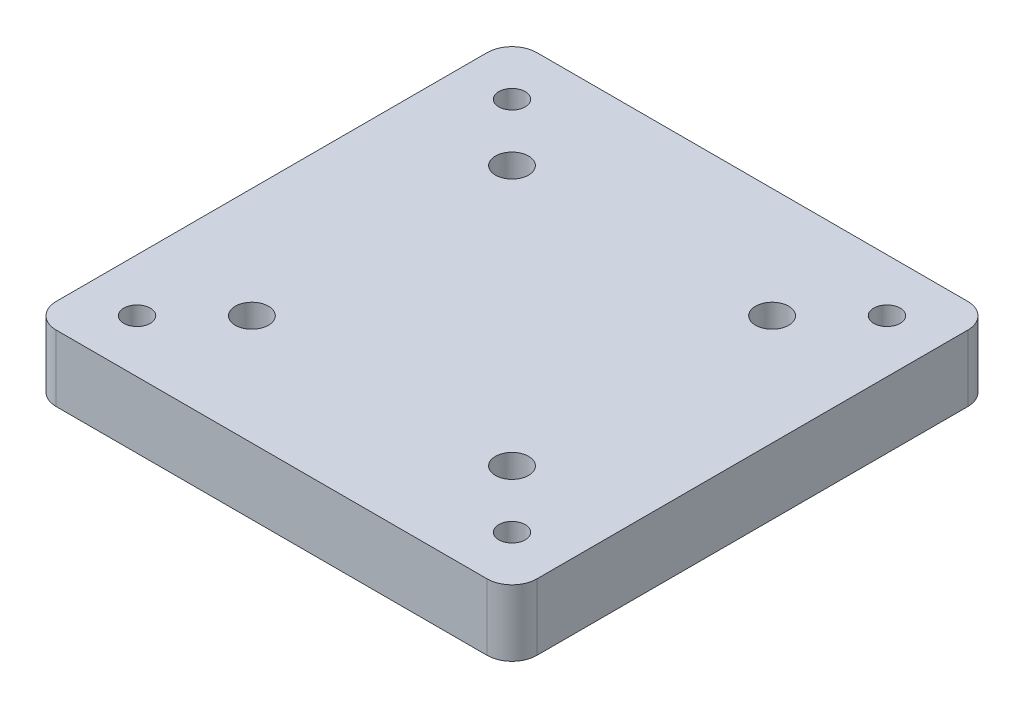
ISO-10303-21;
HEADER;
FILE_DESCRIPTION(('STEP AP214'),'2;1');
FILE_NAME('part.step','',(''),(''),'','','');
FILE_SCHEMA(('AUTOMOTIVE_DESIGN { 1 0 10303 214 1 1 1 1 }'));
ENDSEC;
DATA;
#1=APPLICATION_CONTEXT('core data for automotive mechanical design processes');
#2=APPLICATION_PROTOCOL_DEFINITION('international standard','automotive_design',2000,#1);
#3=PRODUCT_CONTEXT('',#1,'mechanical');
#4=PRODUCT('Part','Part','',(#3));
#5=PRODUCT_RELATED_PRODUCT_CATEGORY('part','',(#4));
#6=PRODUCT_DEFINITION_FORMATION('','',#4);
#7=PRODUCT_DEFINITION_CONTEXT('part definition',#1,'design');
#8=PRODUCT_DEFINITION('design','',#6,#7);
#9=PRODUCT_DEFINITION_SHAPE('','',#8);
#10=(LENGTH_UNIT() NAMED_UNIT(*) SI_UNIT(.MILLI.,.METRE.));
#11=(NAMED_UNIT(*) PLANE_ANGLE_UNIT() SI_UNIT($,.RADIAN.));
#12=(NAMED_UNIT(*) SI_UNIT($,.STERADIAN.) SOLID_ANGLE_UNIT());
#13=UNCERTAINTY_MEASURE_WITH_UNIT(LENGTH_MEASURE(1.E-05),#10,'distance_accuracy_value','');
#14=(GEOMETRIC_REPRESENTATION_CONTEXT(3) GLOBAL_UNCERTAINTY_ASSIGNED_CONTEXT((#13)) GLOBAL_UNIT_ASSIGNED_CONTEXT((#10,
#11,#12)) REPRESENTATION_CONTEXT('',''));
#15=CARTESIAN_POINT('',(0.,0.,0.));
#16=DIRECTION('',(0.,0.,1.));
#17=DIRECTION('',(1.,0.,0.));
#18=AXIS2_PLACEMENT_3D('',#15,#16,#17);
#19=CARTESIAN_POINT('',(-76.3410285265342,8.,55.2618637242953));
#20=DIRECTION('',(0.,-1.,0.));
#21=DIRECTION('',(0.,0.,-1.));
#22=AXIS2_PLACEMENT_3D('',#19,#20,#21);
#23=CYLINDRICAL_SURFACE('',#22,3.);
#24=CARTESIAN_POINT('',(-76.3410285265342,0.,55.2618637242953));
#25=DIRECTION('',(0.,1.,0.));
#26=DIRECTION('',(0.,0.,1.));
#27=AXIS2_PLACEMENT_3D('',#24,#25,#26);
#28=CIRCLE('',#27,3.);
#29=CARTESIAN_POINT('',(-76.3410285265341,0.,58.2618637242953));
#30=VERTEX_POINT('',#29);
#31=CARTESIAN_POINT('',(-79.3410285265342,0.,55.2618637242953));
#32=VERTEX_POINT('',#31);
#33=EDGE_CURVE('E202',#30,#32,#28,.F.);
#34=ORIENTED_EDGE('',*,*,#33,.F.);
#35=DIRECTION('',(0.,-1.,0.));
#36=VECTOR('',#35,1.);
#37=CARTESIAN_POINT('',(-76.3410285265341,8.,58.2618637242953));
#38=LINE('',#37,#36);
#39=CARTESIAN_POINT('',(-76.3410285265341,8.,58.2618637242953));
#40=VERTEX_POINT('',#39);
#41=EDGE_CURVE('E12',#40,#30,#38,.T.);
#42=ORIENTED_EDGE('',*,*,#41,.F.);
#43=CARTESIAN_POINT('',(-76.3410285265342,8.,55.2618637242953));
#44=DIRECTION('',(0.,1.,0.));
#45=DIRECTION('',(0.,0.,1.));
#46=AXIS2_PLACEMENT_3D('',#43,#44,#45);
#47=CIRCLE('',#46,3.);
#48=CARTESIAN_POINT('',(-79.3410285265342,8.,55.2618637242953));
#49=VERTEX_POINT('',#48);
#50=EDGE_CURVE('E246',#40,#49,#47,.F.);
#51=ORIENTED_EDGE('',*,*,#50,.T.);
#52=DIRECTION('',(0.,-1.,0.));
#53=VECTOR('',#52,1.);
#54=CARTESIAN_POINT('',(-79.3410285265342,8.,55.2618637242953));
#55=LINE('',#54,#53);
#56=EDGE_CURVE('E85',#49,#32,#55,.T.);
#57=ORIENTED_EDGE('',*,*,#56,.T.);
#58=EDGE_LOOP('',(#34,#42,#51,#57));
#59=FACE_BOUND('',#58,.T.);
#60=ADVANCED_FACE('F68',(#59),#23,.T.);
#61=CARTESIAN_POINT('',(0.,8.,58.2618637242953));
#62=DIRECTION('',(0.,0.,-1.));
#63=DIRECTION('',(-1.,0.,0.));
#64=AXIS2_PLACEMENT_3D('',#61,#62,#63);
#65=PLANE('',#64);
#66=DIRECTION('',(1.,0.,0.));
#67=VECTOR('',#66,1.);
#68=CARTESIAN_POINT('',(0.,0.,58.2618637242953));
#69=LINE('',#68,#67);
#70=CARTESIAN_POINT('',(-24.3410285265342,0.,58.2618637242953));
#71=VERTEX_POINT('',#70);
#72=EDGE_CURVE('E205',#30,#71,#69,.T.);
#73=ORIENTED_EDGE('',*,*,#72,.T.);
#74=DIRECTION('',(0.,-1.,0.));
#75=VECTOR('',#74,1.);
#76=CARTESIAN_POINT('',(-24.3410285265342,8.,58.2618637242953));
#77=LINE('',#76,#75);
#78=CARTESIAN_POINT('',(-24.3410285265342,8.,58.2618637242953));
#79=VERTEX_POINT('',#78);
#80=EDGE_CURVE('E77',#79,#71,#77,.T.);
#81=ORIENTED_EDGE('',*,*,#80,.F.);
#82=DIRECTION('',(1.,0.,0.));
#83=VECTOR('',#82,1.);
#84=CARTESIAN_POINT('',(0.,8.,58.2618637242953));
#85=LINE('',#84,#83);
#86=EDGE_CURVE('E446',#40,#79,#85,.T.);
#87=ORIENTED_EDGE('',*,*,#86,.F.);
#88=ORIENTED_EDGE('',*,*,#41,.T.);
#89=EDGE_LOOP('',(#73,#81,#87,#88));
#90=FACE_BOUND('',#89,.T.);
#91=ADVANCED_FACE('F269',(#90),#65,.F.);
#92=CARTESIAN_POINT('',(-24.3410285265342,8.,55.2618637242953));
#93=DIRECTION('',(0.,-1.,0.));
#94=DIRECTION('',(0.,0.,-1.));
#95=AXIS2_PLACEMENT_3D('',#92,#93,#94);
#96=CYLINDRICAL_SURFACE('',#95,3.);
#97=CARTESIAN_POINT('',(-24.3410285265342,0.,55.2618637242953));
#98=DIRECTION('',(0.,1.,0.));
#99=DIRECTION('',(0.,0.,1.));
#100=AXIS2_PLACEMENT_3D('',#97,#98,#99);
#101=CIRCLE('',#100,3.);
#102=CARTESIAN_POINT('',(-21.3410285265342,0.,55.2618637242953));
#103=VERTEX_POINT('',#102);
#104=EDGE_CURVE('E210',#103,#71,#101,.F.);
#105=ORIENTED_EDGE('',*,*,#104,.F.);
#106=DIRECTION('',(0.,-1.,0.));
#107=VECTOR('',#106,1.);
#108=CARTESIAN_POINT('',(-21.3410285265342,8.,55.2618637242953));
#109=LINE('',#108,#107);
#110=CARTESIAN_POINT('',(-21.3410285265342,8.,55.2618637242953));
#111=VERTEX_POINT('',#110);
#112=EDGE_CURVE('E257',#111,#103,#109,.T.);
#113=ORIENTED_EDGE('',*,*,#112,.F.);
#114=CARTESIAN_POINT('',(-24.3410285265342,8.,55.2618637242953));
#115=DIRECTION('',(0.,1.,0.));
#116=DIRECTION('',(0.,0.,1.));
#117=AXIS2_PLACEMENT_3D('',#114,#115,#116);
#118=CIRCLE('',#117,3.);
#119=EDGE_CURVE('E266',#111,#79,#118,.F.);
#120=ORIENTED_EDGE('',*,*,#119,.T.);
#121=ORIENTED_EDGE('',*,*,#80,.T.);
#122=EDGE_LOOP('',(#105,#113,#120,#121));
#123=FACE_BOUND('',#122,.T.);
#124=ADVANCED_FACE('F264',(#123),#96,.T.);
#125=CARTESIAN_POINT('',(-21.3410285265342,8.,0.));
#126=DIRECTION('',(-1.,0.,0.));
#127=DIRECTION('',(0.,0.,1.));
#128=AXIS2_PLACEMENT_3D('',#125,#126,#127);
#129=PLANE('',#128);
#130=DIRECTION('',(0.,0.,-1.));
#131=VECTOR('',#130,1.);
#132=CARTESIAN_POINT('',(-21.3410285265342,0.,0.));
#133=LINE('',#132,#131);
#134=CARTESIAN_POINT('',(-21.3410285265342,0.,3.26186372429536));
#135=VERTEX_POINT('',#134);
#136=EDGE_CURVE('E214',#103,#135,#133,.T.);
#137=ORIENTED_EDGE('',*,*,#136,.T.);
#138=DIRECTION('',(0.,-1.,0.));
#139=VECTOR('',#138,1.);
#140=CARTESIAN_POINT('',(-21.3410285265342,8.,3.26186372429536));
#141=LINE('',#140,#139);
#142=CARTESIAN_POINT('',(-21.3410285265342,8.,3.26186372429536));
#143=VERTEX_POINT('',#142);
#144=EDGE_CURVE('E253',#143,#135,#141,.T.);
#145=ORIENTED_EDGE('',*,*,#144,.F.);
#146=DIRECTION('',(0.,0.,-1.));
#147=VECTOR('',#146,1.);
#148=CARTESIAN_POINT('',(-21.3410285265342,8.,0.));
#149=LINE('',#148,#147);
#150=EDGE_CURVE('E164',#111,#143,#149,.T.);
#151=ORIENTED_EDGE('',*,*,#150,.F.);
#152=ORIENTED_EDGE('',*,*,#112,.T.);
#153=EDGE_LOOP('',(#137,#145,#151,#152));
#154=FACE_BOUND('',#153,.T.);
#155=ADVANCED_FACE('F277',(#154),#129,.F.);
#156=CARTESIAN_POINT('',(-24.3410285265342,8.,3.26186372429534));
#157=DIRECTION('',(0.,-1.,0.));
#158=DIRECTION('',(0.,0.,-1.));
#159=AXIS2_PLACEMENT_3D('',#156,#157,#158);
#160=CYLINDRICAL_SURFACE('',#159,3.);
#161=CARTESIAN_POINT('',(-24.3410285265342,0.,3.26186372429534));
#162=DIRECTION('',(0.,1.,0.));
#163=DIRECTION('',(0.,0.,1.));
#164=AXIS2_PLACEMENT_3D('',#161,#162,#163);
#165=CIRCLE('',#164,3.);
#166=CARTESIAN_POINT('',(-24.3410285265342,0.,0.26186372429534));
#167=VERTEX_POINT('',#166);
#168=EDGE_CURVE('E217',#135,#167,#165,.T.);
#169=ORIENTED_EDGE('',*,*,#168,.T.);
#170=DIRECTION('',(0.,-1.,0.));
#171=VECTOR('',#170,1.);
#172=CARTESIAN_POINT('',(-24.3410285265342,8.,0.26186372429534));
#173=LINE('',#172,#171);
#174=CARTESIAN_POINT('',(-24.3410285265342,8.,0.26186372429534));
#175=VERTEX_POINT('',#174);
#176=EDGE_CURVE('E146',#175,#167,#173,.T.);
#177=ORIENTED_EDGE('',*,*,#176,.F.);
#178=CARTESIAN_POINT('',(-24.3410285265342,8.,3.26186372429534));
#179=DIRECTION('',(0.,1.,0.));
#180=DIRECTION('',(0.,0.,1.));
#181=AXIS2_PLACEMENT_3D('',#178,#179,#180);
#182=CIRCLE('',#181,3.);
#183=EDGE_CURVE('E159',#143,#175,#182,.T.);
#184=ORIENTED_EDGE('',*,*,#183,.F.);
#185=ORIENTED_EDGE('',*,*,#144,.T.);
#186=EDGE_LOOP('',(#169,#177,#184,#185));
#187=FACE_BOUND('',#186,.T.);
#188=ADVANCED_FACE('F280',(#187),#160,.T.);
#189=CARTESIAN_POINT('',(0.,8.,0.26186372429534));
#190=DIRECTION('',(0.,0.,-1.));
#191=DIRECTION('',(-1.,0.,0.));
#192=AXIS2_PLACEMENT_3D('',#189,#190,#191);
#193=PLANE('',#192);
#194=DIRECTION('',(1.,0.,0.));
#195=VECTOR('',#194,1.);
#196=CARTESIAN_POINT('',(0.,0.,0.26186372429534));
#197=LINE('',#196,#195);
#198=CARTESIAN_POINT('',(-76.3410285265341,0.,0.26186372429534));
#199=VERTEX_POINT('',#198);
#200=EDGE_CURVE('E142',#199,#167,#197,.T.);
#201=ORIENTED_EDGE('',*,*,#200,.F.);
#202=DIRECTION('',(0.,-1.,0.));
#203=VECTOR('',#202,1.);
#204=CARTESIAN_POINT('',(-76.3410285265341,8.,0.26186372429534));
#205=LINE('',#204,#203);
#206=CARTESIAN_POINT('',(-76.3410285265341,8.,0.26186372429534));
#207=VERTEX_POINT('',#206);
#208=EDGE_CURVE('E136',#207,#199,#205,.T.);
#209=ORIENTED_EDGE('',*,*,#208,.F.);
#210=DIRECTION('',(1.,0.,0.));
#211=VECTOR('',#210,1.);
#212=CARTESIAN_POINT('',(0.,8.,0.26186372429534));
#213=LINE('',#212,#211);
#214=EDGE_CURVE('E140',#207,#175,#213,.T.);
#215=ORIENTED_EDGE('',*,*,#214,.T.);
#216=ORIENTED_EDGE('',*,*,#176,.T.);
#217=EDGE_LOOP('',(#201,#209,#215,#216));
#218=FACE_BOUND('',#217,.T.);
#219=ADVANCED_FACE('F138',(#218),#193,.T.);
#220=CARTESIAN_POINT('',(-76.3410285265342,8.,3.26186372429534));
#221=DIRECTION('',(0.,-1.,0.));
#222=DIRECTION('',(0.,0.,-1.));
#223=AXIS2_PLACEMENT_3D('',#220,#221,#222);
#224=CYLINDRICAL_SURFACE('',#223,3.);
#225=CARTESIAN_POINT('',(-76.3410285265342,0.,3.26186372429534));
#226=DIRECTION('',(0.,1.,0.));
#227=DIRECTION('',(0.,0.,1.));
#228=AXIS2_PLACEMENT_3D('',#225,#226,#227);
#229=CIRCLE('',#228,3.);
#230=CARTESIAN_POINT('',(-79.3410285265342,0.,3.26186372429536));
#231=VERTEX_POINT('',#230);
#232=EDGE_CURVE('E223',#199,#231,#229,.T.);
#233=ORIENTED_EDGE('',*,*,#232,.T.);
#234=DIRECTION('',(0.,-1.,0.));
#235=VECTOR('',#234,1.);
#236=CARTESIAN_POINT('',(-79.3410285265342,8.,3.26186372429536));
#237=LINE('',#236,#235);
#238=CARTESIAN_POINT('',(-79.3410285265342,8.,3.26186372429536));
#239=VERTEX_POINT('',#238);
#240=EDGE_CURVE('E111',#239,#231,#237,.T.);
#241=ORIENTED_EDGE('',*,*,#240,.F.);
#242=CARTESIAN_POINT('',(-76.3410285265342,8.,3.26186372429534));
#243=DIRECTION('',(0.,1.,0.));
#244=DIRECTION('',(0.,0.,1.));
#245=AXIS2_PLACEMENT_3D('',#242,#243,#244);
#246=CIRCLE('',#245,3.);
#247=EDGE_CURVE('E148',#207,#239,#246,.T.);
#248=ORIENTED_EDGE('',*,*,#247,.F.);
#249=ORIENTED_EDGE('',*,*,#208,.T.);
#250=EDGE_LOOP('',(#233,#241,#248,#249));
#251=FACE_BOUND('',#250,.T.);
#252=ADVANCED_FACE('F149',(#251),#224,.T.);
#253=CARTESIAN_POINT('',(-66.0360285265342,8.,44.9568637242954));
#254=DIRECTION('',(0.,-1.,0.));
#255=DIRECTION('',(0.,0.,-1.));
#256=AXIS2_PLACEMENT_3D('',#253,#254,#255);
#257=CYLINDRICAL_SURFACE('',#256,2.);
#258=CARTESIAN_POINT('',(-66.0360285265342,8.,44.9568637242954));
#259=DIRECTION('',(0.,1.,0.));
#260=DIRECTION('',(0.,0.,1.));
#261=AXIS2_PLACEMENT_3D('',#258,#259,#260);
#262=CIRCLE('',#261,2.);
#263=CARTESIAN_POINT('',(-66.0360285265342,8.,46.9568637242953));
#264=VERTEX_POINT('',#263);
#265=EDGE_CURVE('E194',#264,#264,#262,.T.);
#266=ORIENTED_EDGE('',*,*,#265,.T.);
#267=EDGE_LOOP('',(#266));
#268=FACE_BOUND('',#267,.T.);
#269=CARTESIAN_POINT('',(-66.0360285265342,-2.,44.9568637242954));
#270=DIRECTION('',(0.,1.,0.));
#271=DIRECTION('',(0.,0.,1.));
#272=AXIS2_PLACEMENT_3D('',#269,#270,#271);
#273=CIRCLE('',#272,2.);
#274=CARTESIAN_POINT('',(-66.0360285265342,-2.,46.9568637242953));
#275=VERTEX_POINT('',#274);
#276=EDGE_CURVE('E426',#275,#275,#273,.T.);
#277=ORIENTED_EDGE('',*,*,#276,.F.);
#278=EDGE_LOOP('',(#277));
#279=FACE_BOUND('',#278,.T.);
#280=ADVANCED_FACE('F311',(#268,#279),#257,.F.);
#281=CARTESIAN_POINT('',(-34.6460285265341,8.,13.5668637242953));
#282=DIRECTION('',(0.,-1.,0.));
#283=DIRECTION('',(0.,0.,-1.));
#284=AXIS2_PLACEMENT_3D('',#281,#282,#283);
#285=CYLINDRICAL_SURFACE('',#284,2.);
#286=CARTESIAN_POINT('',(-34.6460285265341,8.,13.5668637242953));
#287=DIRECTION('',(0.,1.,0.));
#288=DIRECTION('',(0.,0.,1.));
#289=AXIS2_PLACEMENT_3D('',#286,#287,#288);
#290=CIRCLE('',#289,2.);
#291=CARTESIAN_POINT('',(-34.6460285265341,8.,15.5668637242953));
#292=VERTEX_POINT('',#291);
#293=EDGE_CURVE('E190',#292,#292,#290,.T.);
#294=ORIENTED_EDGE('',*,*,#293,.T.);
#295=EDGE_LOOP('',(#294));
#296=FACE_BOUND('',#295,.T.);
#297=CARTESIAN_POINT('',(-34.6460285265341,-2.,13.5668637242953));
#298=DIRECTION('',(0.,1.,0.));
#299=DIRECTION('',(0.,0.,1.));
#300=AXIS2_PLACEMENT_3D('',#297,#298,#299);
#301=CIRCLE('',#300,2.);
#302=CARTESIAN_POINT('',(-34.6460285265341,-2.,15.5668637242953));
#303=VERTEX_POINT('',#302);
#304=EDGE_CURVE('E401',#303,#303,#301,.T.);
#305=ORIENTED_EDGE('',*,*,#304,.F.);
#306=EDGE_LOOP('',(#305));
#307=FACE_BOUND('',#306,.T.);
#308=ADVANCED_FACE('F315',(#296,#307),#285,.F.);
#309=CARTESIAN_POINT('',(-66.0360285265342,8.,13.5668637242953));
#310=DIRECTION('',(0.,-1.,0.));
#311=DIRECTION('',(0.,0.,-1.));
#312=AXIS2_PLACEMENT_3D('',#309,#310,#311);
#313=CYLINDRICAL_SURFACE('',#312,2.);
#314=CARTESIAN_POINT('',(-66.0360285265342,8.,13.5668637242953));
#315=DIRECTION('',(0.,1.,0.));
#316=DIRECTION('',(0.,0.,1.));
#317=AXIS2_PLACEMENT_3D('',#314,#315,#316);
#318=CIRCLE('',#317,2.);
#319=CARTESIAN_POINT('',(-66.0360285265342,8.,15.5668637242953));
#320=VERTEX_POINT('',#319);
#321=EDGE_CURVE('E186',#320,#320,#318,.T.);
#322=ORIENTED_EDGE('',*,*,#321,.T.);
#323=EDGE_LOOP('',(#322));
#324=FACE_BOUND('',#323,.T.);
#325=CARTESIAN_POINT('',(-66.0360285265342,-2.,13.5668637242953));
#326=DIRECTION('',(0.,1.,0.));
#327=DIRECTION('',(0.,0.,1.));
#328=AXIS2_PLACEMENT_3D('',#325,#326,#327);
#329=CIRCLE('',#328,2.);
#330=CARTESIAN_POINT('',(-66.0360285265342,-2.,15.5668637242953));
#331=VERTEX_POINT('',#330);
#332=EDGE_CURVE('E414',#331,#331,#329,.T.);
#333=ORIENTED_EDGE('',*,*,#332,.F.);
#334=EDGE_LOOP('',(#333));
#335=FACE_BOUND('',#334,.T.);
#336=ADVANCED_FACE('F321',(#324,#335),#313,.F.);
#337=CARTESIAN_POINT('',(-72.9660285265341,8.,6.63686372429535));
#338=DIRECTION('',(0.,-1.,0.));
#339=DIRECTION('',(0.,0.,-1.));
#340=AXIS2_PLACEMENT_3D('',#337,#338,#339);
#341=CYLINDRICAL_SURFACE('',#340,1.59867119920185);
#342=CARTESIAN_POINT('',(-72.9660285265341,8.,6.63686372429535));
#343=DIRECTION('',(0.,1.,0.));
#344=DIRECTION('',(0.,0.,1.));
#345=AXIS2_PLACEMENT_3D('',#342,#343,#344);
#346=CIRCLE('',#345,1.59867119920185);
#347=CARTESIAN_POINT('',(-72.9660285265341,8.,8.2355349234972));
#348=VERTEX_POINT('',#347);
#349=EDGE_CURVE('E182',#348,#348,#346,.T.);
#350=ORIENTED_EDGE('',*,*,#349,.T.);
#351=EDGE_LOOP('',(#350));
#352=FACE_BOUND('',#351,.T.);
#353=CARTESIAN_POINT('',(-72.9660285265341,0.,6.63686372429535));
#354=DIRECTION('',(0.,1.,0.));
#355=DIRECTION('',(0.,0.,1.));
#356=AXIS2_PLACEMENT_3D('',#353,#354,#355);
#357=CIRCLE('',#356,1.59867119920185);
#358=CARTESIAN_POINT('',(-72.9660285265341,0.,8.2355349234972));
#359=VERTEX_POINT('',#358);
#360=EDGE_CURVE('E242',#359,#359,#357,.T.);
#361=ORIENTED_EDGE('',*,*,#360,.F.);
#362=EDGE_LOOP('',(#361));
#363=FACE_BOUND('',#362,.T.);
#364=ADVANCED_FACE('F329',(#352,#363),#341,.F.);
#365=CARTESIAN_POINT('',(-27.7160285265342,8.,6.63686372429535));
#366=DIRECTION('',(0.,-1.,0.));
#367=DIRECTION('',(0.,0.,-1.));
#368=AXIS2_PLACEMENT_3D('',#365,#366,#367);
#369=CYLINDRICAL_SURFACE('',#368,1.6);
#370=CARTESIAN_POINT('',(-27.7160285265342,8.,6.63686372429535));
#371=DIRECTION('',(0.,1.,0.));
#372=DIRECTION('',(0.,0.,1.));
#373=AXIS2_PLACEMENT_3D('',#370,#371,#372);
#374=CIRCLE('',#373,1.6);
#375=CARTESIAN_POINT('',(-27.7160285265342,8.,8.23686372429535));
#376=VERTEX_POINT('',#375);
#377=EDGE_CURVE('E178',#376,#376,#374,.T.);
#378=ORIENTED_EDGE('',*,*,#377,.T.);
#379=EDGE_LOOP('',(#378));
#380=FACE_BOUND('',#379,.T.);
#381=CARTESIAN_POINT('',(-27.7160285265342,0.,6.63686372429535));
#382=DIRECTION('',(0.,1.,0.));
#383=DIRECTION('',(0.,0.,1.));
#384=AXIS2_PLACEMENT_3D('',#381,#382,#383);
#385=CIRCLE('',#384,1.6);
#386=CARTESIAN_POINT('',(-27.7160285265342,0.,8.23686372429535));
#387=VERTEX_POINT('',#386);
#388=EDGE_CURVE('E238',#387,#387,#385,.T.);
#389=ORIENTED_EDGE('',*,*,#388,.F.);
#390=EDGE_LOOP('',(#389));
#391=FACE_BOUND('',#390,.T.);
#392=ADVANCED_FACE('F333',(#380,#391),#369,.F.);
#393=CARTESIAN_POINT('',(-27.7160285265342,8.,51.8868637242953));
#394=DIRECTION('',(0.,-1.,0.));
#395=DIRECTION('',(0.,0.,-1.));
#396=AXIS2_PLACEMENT_3D('',#393,#394,#395);
#397=CYLINDRICAL_SURFACE('',#396,1.59864976084246);
#398=CARTESIAN_POINT('',(-27.7160285265342,8.,51.8868637242953));
#399=DIRECTION('',(0.,1.,0.));
#400=DIRECTION('',(0.,0.,1.));
#401=AXIS2_PLACEMENT_3D('',#398,#399,#400);
#402=CIRCLE('',#401,1.59864976084246);
#403=CARTESIAN_POINT('',(-27.7160285265342,8.,53.4855134851378));
#404=VERTEX_POINT('',#403);
#405=EDGE_CURVE('E174',#404,#404,#402,.T.);
#406=ORIENTED_EDGE('',*,*,#405,.T.);
#407=EDGE_LOOP('',(#406));
#408=FACE_BOUND('',#407,.T.);
#409=CARTESIAN_POINT('',(-27.7160285265342,0.,51.8868637242953));
#410=DIRECTION('',(0.,1.,0.));
#411=DIRECTION('',(0.,0.,1.));
#412=AXIS2_PLACEMENT_3D('',#409,#410,#411);
#413=CIRCLE('',#412,1.59864976084246);
#414=CARTESIAN_POINT('',(-27.7160285265342,0.,53.4855134851378));
#415=VERTEX_POINT('',#414);
#416=EDGE_CURVE('E234',#415,#415,#413,.T.);
#417=ORIENTED_EDGE('',*,*,#416,.F.);
#418=EDGE_LOOP('',(#417));
#419=FACE_BOUND('',#418,.T.);
#420=ADVANCED_FACE('F292',(#408,#419),#397,.F.);
#421=CARTESIAN_POINT('',(-72.9660285265341,8.,51.8868637242953));
#422=DIRECTION('',(0.,-1.,0.));
#423=DIRECTION('',(0.,0.,-1.));
#424=AXIS2_PLACEMENT_3D('',#421,#422,#423);
#425=CYLINDRICAL_SURFACE('',#424,1.59999999999998);
#426=CARTESIAN_POINT('',(-72.9660285265341,8.,51.8868637242953));
#427=DIRECTION('',(0.,1.,0.));
#428=DIRECTION('',(0.,0.,1.));
#429=AXIS2_PLACEMENT_3D('',#426,#427,#428);
#430=CIRCLE('',#429,1.59999999999998);
#431=CARTESIAN_POINT('',(-72.9660285265341,8.,53.4868637242953));
#432=VERTEX_POINT('',#431);
#433=EDGE_CURVE('E170',#432,#432,#430,.T.);
#434=ORIENTED_EDGE('',*,*,#433,.T.);
#435=EDGE_LOOP('',(#434));
#436=FACE_BOUND('',#435,.T.);
#437=CARTESIAN_POINT('',(-72.9660285265341,0.,51.8868637242953));
#438=DIRECTION('',(0.,1.,0.));
#439=DIRECTION('',(0.,0.,1.));
#440=AXIS2_PLACEMENT_3D('',#437,#438,#439);
#441=CIRCLE('',#440,1.59999999999998);
#442=CARTESIAN_POINT('',(-72.9660285265341,0.,53.4868637242953));
#443=VERTEX_POINT('',#442);
#444=EDGE_CURVE('E230',#443,#443,#441,.T.);
#445=ORIENTED_EDGE('',*,*,#444,.F.);
#446=EDGE_LOOP('',(#445));
#447=FACE_BOUND('',#446,.T.);
#448=ADVANCED_FACE('F284',(#436,#447),#425,.F.);
#449=CARTESIAN_POINT('',(-79.3410285265342,8.,0.));
#450=DIRECTION('',(-1.,0.,0.));
#451=DIRECTION('',(0.,0.,1.));
#452=AXIS2_PLACEMENT_3D('',#449,#450,#451);
#453=PLANE('',#452);
#454=DIRECTION('',(0.,0.,-1.));
#455=VECTOR('',#454,1.);
#456=CARTESIAN_POINT('',(-79.3410285265342,0.,0.));
#457=LINE('',#456,#455);
#458=EDGE_CURVE('E226',#32,#231,#457,.T.);
#459=ORIENTED_EDGE('',*,*,#458,.F.);
#460=ORIENTED_EDGE('',*,*,#56,.F.);
#461=DIRECTION('',(0.,0.,-1.));
#462=VECTOR('',#461,1.);
#463=CARTESIAN_POINT('',(-79.3410285265342,8.,0.));
#464=LINE('',#463,#462);
#465=EDGE_CURVE('E153',#49,#239,#464,.T.);
#466=ORIENTED_EDGE('',*,*,#465,.T.);
#467=ORIENTED_EDGE('',*,*,#240,.T.);
#468=EDGE_LOOP('',(#459,#460,#466,#467));
#469=FACE_BOUND('',#468,.T.);
#470=ADVANCED_FACE('F281',(#469),#453,.T.);
#471=CARTESIAN_POINT('',(-34.6460285265341,8.,44.9568637242954));
#472=DIRECTION('',(0.,-1.,0.));
#473=DIRECTION('',(0.,0.,-1.));
#474=AXIS2_PLACEMENT_3D('',#471,#472,#473);
#475=CYLINDRICAL_SURFACE('',#474,2.);
#476=CARTESIAN_POINT('',(-34.6460285265341,8.,44.9568637242954));
#477=DIRECTION('',(0.,1.,0.));
#478=DIRECTION('',(0.,0.,1.));
#479=AXIS2_PLACEMENT_3D('',#476,#477,#478);
#480=CIRCLE('',#479,2.);
#481=CARTESIAN_POINT('',(-34.6460285265341,8.,46.9568637242954));
#482=VERTEX_POINT('',#481);
#483=EDGE_CURVE('E198',#482,#482,#480,.T.);
#484=ORIENTED_EDGE('',*,*,#483,.T.);
#485=EDGE_LOOP('',(#484));
#486=FACE_BOUND('',#485,.T.);
#487=CARTESIAN_POINT('',(-34.6460285265341,-2.,44.9568637242954));
#488=DIRECTION('',(0.,1.,0.));
#489=DIRECTION('',(0.,0.,1.));
#490=AXIS2_PLACEMENT_3D('',#487,#488,#489);
#491=CIRCLE('',#490,2.);
#492=CARTESIAN_POINT('',(-34.6460285265341,-2.,46.9568637242954));
#493=VERTEX_POINT('',#492);
#494=EDGE_CURVE('E433',#493,#493,#491,.T.);
#495=ORIENTED_EDGE('',*,*,#494,.F.);
#496=EDGE_LOOP('',(#495));
#497=FACE_BOUND('',#496,.T.);
#498=ADVANCED_FACE('F283',(#486,#497),#475,.F.);
#499=CARTESIAN_POINT('',(0.,8.,0.));
#500=DIRECTION('',(0.,1.,0.));
#501=DIRECTION('',(0.,0.,1.));
#502=AXIS2_PLACEMENT_3D('',#499,#500,#501);
#503=PLANE('',#502);
#504=ORIENTED_EDGE('',*,*,#50,.F.);
#505=ORIENTED_EDGE('',*,*,#86,.T.);
#506=ORIENTED_EDGE('',*,*,#119,.F.);
#507=ORIENTED_EDGE('',*,*,#150,.T.);
#508=ORIENTED_EDGE('',*,*,#183,.T.);
#509=ORIENTED_EDGE('',*,*,#214,.F.);
#510=ORIENTED_EDGE('',*,*,#247,.T.);
#511=ORIENTED_EDGE('',*,*,#465,.F.);
#512=EDGE_LOOP('',(#504,#505,#506,#507,#508,#509,#510,#511));
#513=FACE_BOUND('',#512,.T.);
#514=ORIENTED_EDGE('',*,*,#433,.F.);
#515=EDGE_LOOP('',(#514));
#516=FACE_BOUND('',#515,.T.);
#517=ORIENTED_EDGE('',*,*,#405,.F.);
#518=EDGE_LOOP('',(#517));
#519=FACE_BOUND('',#518,.T.);
#520=ORIENTED_EDGE('',*,*,#377,.F.);
#521=EDGE_LOOP('',(#520));
#522=FACE_BOUND('',#521,.T.);
#523=ORIENTED_EDGE('',*,*,#349,.F.);
#524=EDGE_LOOP('',(#523));
#525=FACE_BOUND('',#524,.T.);
#526=ORIENTED_EDGE('',*,*,#321,.F.);
#527=EDGE_LOOP('',(#526));
#528=FACE_BOUND('',#527,.T.);
#529=ORIENTED_EDGE('',*,*,#293,.F.);
#530=EDGE_LOOP('',(#529));
#531=FACE_BOUND('',#530,.T.);
#532=ORIENTED_EDGE('',*,*,#265,.F.);
#533=EDGE_LOOP('',(#532));
#534=FACE_BOUND('',#533,.T.);
#535=ORIENTED_EDGE('',*,*,#483,.F.);
#536=EDGE_LOOP('',(#535));
#537=FACE_BOUND('',#536,.T.);
#538=ADVANCED_FACE('F156',(#513,#516,#519,#522,#525,#528,#531,#534,#537),#503,.T.);
#539=CARTESIAN_POINT('',(0.,0.,0.));
#540=DIRECTION('',(0.,1.,0.));
#541=DIRECTION('',(0.,0.,1.));
#542=AXIS2_PLACEMENT_3D('',#539,#540,#541);
#543=PLANE('',#542);
#544=CARTESIAN_POINT('',(-34.6460285265341,0.,13.5668637242953));
#545=DIRECTION('',(0.,1.,0.));
#546=DIRECTION('',(0.,0.,1.));
#547=AXIS2_PLACEMENT_3D('',#544,#545,#546);
#548=CIRCLE('',#547,6.);
#549=CARTESIAN_POINT('',(-34.6460285265341,0.,19.5668637242953));
#550=VERTEX_POINT('',#549);
#551=EDGE_CURVE('E399',#550,#550,#548,.T.);
#552=ORIENTED_EDGE('',*,*,#551,.T.);
#553=EDGE_LOOP('',(#552));
#554=FACE_BOUND('',#553,.T.);
#555=CARTESIAN_POINT('',(-66.0360285265342,0.,13.5668637242953));
#556=DIRECTION('',(0.,1.,0.));
#557=DIRECTION('',(0.,0.,1.));
#558=AXIS2_PLACEMENT_3D('',#555,#556,#557);
#559=CIRCLE('',#558,6.);
#560=CARTESIAN_POINT('',(-66.0360285265342,0.,19.5668637242953));
#561=VERTEX_POINT('',#560);
#562=EDGE_CURVE('E410',#561,#561,#559,.T.);
#563=ORIENTED_EDGE('',*,*,#562,.T.);
#564=EDGE_LOOP('',(#563));
#565=FACE_BOUND('',#564,.T.);
#566=CARTESIAN_POINT('',(-66.0360285265342,0.,44.9568637242954));
#567=DIRECTION('',(0.,1.,0.));
#568=DIRECTION('',(0.,0.,1.));
#569=AXIS2_PLACEMENT_3D('',#566,#567,#568);
#570=CIRCLE('',#569,6.);
#571=CARTESIAN_POINT('',(-66.0360285265342,0.,50.9568637242954));
#572=VERTEX_POINT('',#571);
#573=EDGE_CURVE('E422',#572,#572,#570,.T.);
#574=ORIENTED_EDGE('',*,*,#573,.T.);
#575=EDGE_LOOP('',(#574));
#576=FACE_BOUND('',#575,.T.);
#577=CARTESIAN_POINT('',(-34.6460285265341,0.,44.9568637242954));
#578=DIRECTION('',(0.,1.,0.));
#579=DIRECTION('',(0.,0.,1.));
#580=AXIS2_PLACEMENT_3D('',#577,#578,#579);
#581=CIRCLE('',#580,6.);
#582=CARTESIAN_POINT('',(-34.6460285265341,0.,50.9568637242954));
#583=VERTEX_POINT('',#582);
#584=EDGE_CURVE('E437',#583,#583,#581,.T.);
#585=ORIENTED_EDGE('',*,*,#584,.T.);
#586=EDGE_LOOP('',(#585));
#587=FACE_BOUND('',#586,.T.);
#588=ORIENTED_EDGE('',*,*,#33,.T.);
#589=ORIENTED_EDGE('',*,*,#458,.T.);
#590=ORIENTED_EDGE('',*,*,#232,.F.);
#591=ORIENTED_EDGE('',*,*,#200,.T.);
#592=ORIENTED_EDGE('',*,*,#168,.F.);
#593=ORIENTED_EDGE('',*,*,#136,.F.);
#594=ORIENTED_EDGE('',*,*,#104,.T.);
#595=ORIENTED_EDGE('',*,*,#72,.F.);
#596=EDGE_LOOP('',(#588,#589,#590,#591,#592,#593,#594,#595));
#597=FACE_BOUND('',#596,.T.);
#598=ORIENTED_EDGE('',*,*,#444,.T.);
#599=EDGE_LOOP('',(#598));
#600=FACE_BOUND('',#599,.T.);
#601=ORIENTED_EDGE('',*,*,#416,.T.);
#602=EDGE_LOOP('',(#601));
#603=FACE_BOUND('',#602,.T.);
#604=ORIENTED_EDGE('',*,*,#388,.T.);
#605=EDGE_LOOP('',(#604));
#606=FACE_BOUND('',#605,.T.);
#607=ORIENTED_EDGE('',*,*,#360,.T.);
#608=EDGE_LOOP('',(#607));
#609=FACE_BOUND('',#608,.T.);
#610=ADVANCED_FACE('F272',(#554,#565,#576,#587,#597,#600,#603,#606,#609),#543,.F.);
#611=CARTESIAN_POINT('',(-34.6460285265341,-2.,44.9568637242954));
#612=DIRECTION('',(0.,1.,0.));
#613=DIRECTION('',(0.,0.,1.));
#614=AXIS2_PLACEMENT_3D('',#611,#612,#613);
#615=CYLINDRICAL_SURFACE('',#614,6.);
#616=CARTESIAN_POINT('',(-34.6460285265341,-2.,44.9568637242954));
#617=DIRECTION('',(0.,1.,0.));
#618=DIRECTION('',(0.,0.,1.));
#619=AXIS2_PLACEMENT_3D('',#616,#617,#618);
#620=CIRCLE('',#619,6.);
#621=CARTESIAN_POINT('',(-34.6460285265341,-2.,50.9568637242954));
#622=VERTEX_POINT('',#621);
#623=EDGE_CURVE('E206',#622,#622,#620,.T.);
#624=ORIENTED_EDGE('',*,*,#623,.T.);
#625=EDGE_LOOP('',(#624));
#626=FACE_BOUND('',#625,.T.);
#627=ORIENTED_EDGE('',*,*,#584,.F.);
#628=EDGE_LOOP('',(#627));
#629=FACE_BOUND('',#628,.T.);
#630=ADVANCED_FACE('F348',(#626,#629),#615,.T.);
#631=CARTESIAN_POINT('',(-34.6460285265341,-2.,44.9568637242954));
#632=DIRECTION('',(0.,1.,0.));
#633=DIRECTION('',(0.,0.,1.));
#634=AXIS2_PLACEMENT_3D('',#631,#632,#633);
#635=PLANE('',#634);
#636=ORIENTED_EDGE('',*,*,#494,.T.);
#637=EDGE_LOOP('',(#636));
#638=FACE_BOUND('',#637,.T.);
#639=ORIENTED_EDGE('',*,*,#623,.F.);
#640=EDGE_LOOP('',(#639));
#641=FACE_BOUND('',#640,.T.);
#642=ADVANCED_FACE('F359',(#638,#641),#635,.F.);
#643=CARTESIAN_POINT('',(-66.0360285265342,-2.,44.9568637242954));
#644=DIRECTION('',(0.,1.,0.));
#645=DIRECTION('',(0.,0.,1.));
#646=AXIS2_PLACEMENT_3D('',#643,#644,#645);
#647=CYLINDRICAL_SURFACE('',#646,6.);
#648=CARTESIAN_POINT('',(-66.0360285265342,-2.,44.9568637242954));
#649=DIRECTION('',(0.,1.,0.));
#650=DIRECTION('',(0.,0.,1.));
#651=AXIS2_PLACEMENT_3D('',#648,#649,#650);
#652=CIRCLE('',#651,6.);
#653=CARTESIAN_POINT('',(-66.0360285265342,-2.,50.9568637242954));
#654=VERTEX_POINT('',#653);
#655=EDGE_CURVE('E421',#654,#654,#652,.T.);
#656=ORIENTED_EDGE('',*,*,#655,.T.);
#657=EDGE_LOOP('',(#656));
#658=FACE_BOUND('',#657,.T.);
#659=ORIENTED_EDGE('',*,*,#573,.F.);
#660=EDGE_LOOP('',(#659));
#661=FACE_BOUND('',#660,.T.);
#662=ADVANCED_FACE('F368',(#658,#661),#647,.T.);
#663=CARTESIAN_POINT('',(-66.0360285265342,-2.,44.9568637242954));
#664=DIRECTION('',(0.,1.,0.));
#665=DIRECTION('',(0.,0.,1.));
#666=AXIS2_PLACEMENT_3D('',#663,#664,#665);
#667=PLANE('',#666);
#668=ORIENTED_EDGE('',*,*,#276,.T.);
#669=EDGE_LOOP('',(#668));
#670=FACE_BOUND('',#669,.T.);
#671=ORIENTED_EDGE('',*,*,#655,.F.);
#672=EDGE_LOOP('',(#671));
#673=FACE_BOUND('',#672,.T.);
#674=ADVANCED_FACE('F370',(#670,#673),#667,.F.);
#675=CARTESIAN_POINT('',(-66.0360285265342,-2.,13.5668637242953));
#676=DIRECTION('',(0.,1.,0.));
#677=DIRECTION('',(0.,0.,1.));
#678=AXIS2_PLACEMENT_3D('',#675,#676,#677);
#679=CYLINDRICAL_SURFACE('',#678,6.);
#680=CARTESIAN_POINT('',(-66.0360285265342,-2.,13.5668637242953));
#681=DIRECTION('',(0.,1.,0.));
#682=DIRECTION('',(0.,0.,1.));
#683=AXIS2_PLACEMENT_3D('',#680,#681,#682);
#684=CIRCLE('',#683,6.);
#685=CARTESIAN_POINT('',(-66.0360285265342,-2.,19.5668637242953));
#686=VERTEX_POINT('',#685);
#687=EDGE_CURVE('E406',#686,#686,#684,.T.);
#688=ORIENTED_EDGE('',*,*,#687,.T.);
#689=EDGE_LOOP('',(#688));
#690=FACE_BOUND('',#689,.T.);
#691=ORIENTED_EDGE('',*,*,#562,.F.);
#692=EDGE_LOOP('',(#691));
#693=FACE_BOUND('',#692,.T.);
#694=ADVANCED_FACE('F373',(#690,#693),#679,.T.);
#695=CARTESIAN_POINT('',(-66.0360285265342,-2.,13.5668637242953));
#696=DIRECTION('',(0.,1.,0.));
#697=DIRECTION('',(0.,0.,1.));
#698=AXIS2_PLACEMENT_3D('',#695,#696,#697);
#699=PLANE('',#698);
#700=ORIENTED_EDGE('',*,*,#332,.T.);
#701=EDGE_LOOP('',(#700));
#702=FACE_BOUND('',#701,.T.);
#703=ORIENTED_EDGE('',*,*,#687,.F.);
#704=EDGE_LOOP('',(#703));
#705=FACE_BOUND('',#704,.T.);
#706=ADVANCED_FACE('F378',(#702,#705),#699,.F.);
#707=CARTESIAN_POINT('',(-34.6460285265341,-2.,13.5668637242953));
#708=DIRECTION('',(0.,1.,0.));
#709=DIRECTION('',(0.,0.,1.));
#710=AXIS2_PLACEMENT_3D('',#707,#708,#709);
#711=CYLINDRICAL_SURFACE('',#710,6.);
#712=CARTESIAN_POINT('',(-34.6460285265341,-2.,13.5668637242953));
#713=DIRECTION('',(0.,1.,0.));
#714=DIRECTION('',(0.,0.,1.));
#715=AXIS2_PLACEMENT_3D('',#712,#713,#714);
#716=CIRCLE('',#715,6.);
#717=CARTESIAN_POINT('',(-34.6460285265341,-2.,19.5668637242953));
#718=VERTEX_POINT('',#717);
#719=EDGE_CURVE('E397',#718,#718,#716,.T.);
#720=ORIENTED_EDGE('',*,*,#719,.T.);
#721=EDGE_LOOP('',(#720));
#722=FACE_BOUND('',#721,.T.);
#723=ORIENTED_EDGE('',*,*,#551,.F.);
#724=EDGE_LOOP('',(#723));
#725=FACE_BOUND('',#724,.T.);
#726=ADVANCED_FACE('F381',(#722,#725),#711,.T.);
#727=CARTESIAN_POINT('',(-34.6460285265341,-2.,13.5668637242953));
#728=DIRECTION('',(0.,1.,0.));
#729=DIRECTION('',(0.,0.,1.));
#730=AXIS2_PLACEMENT_3D('',#727,#728,#729);
#731=PLANE('',#730);
#732=ORIENTED_EDGE('',*,*,#304,.T.);
#733=EDGE_LOOP('',(#732));
#734=FACE_BOUND('',#733,.T.);
#735=ORIENTED_EDGE('',*,*,#719,.F.);
#736=EDGE_LOOP('',(#735));
#737=FACE_BOUND('',#736,.T.);
#738=ADVANCED_FACE('F386',(#734,#737),#731,.F.);
#739=CLOSED_SHELL('',(#60,#91,#124,#155,#188,#219,#252,#280,#308,#336,#364,#392,#420,#448,#470,
#498,#538,#610,#630,#642,#662,#674,#694,#706,#726,#738));
#740=MANIFOLD_SOLID_BREP('B2',#739);
#741=ADVANCED_BREP_SHAPE_REPRESENTATION('',(#18,#740),#14);
#742=SHAPE_DEFINITION_REPRESENTATION(#9,#741);
ENDSEC;
END-ISO-10303-21;
